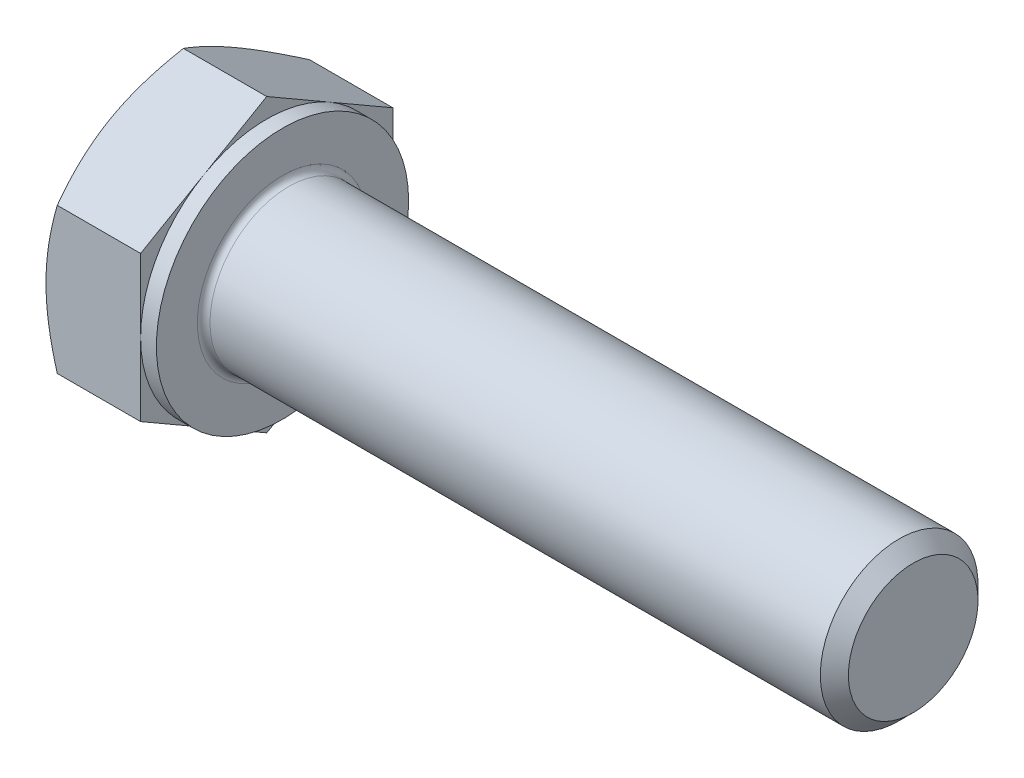
ISO-10303-21;
HEADER;
FILE_DESCRIPTION(('STEP AP214'),'2;1');
FILE_NAME('part.step','',(''),(''),'','','');
FILE_SCHEMA(('AUTOMOTIVE_DESIGN { 1 0 10303 214 1 1 1 1 }'));
ENDSEC;
DATA;
#1=APPLICATION_CONTEXT('core data for automotive mechanical design processes');
#2=APPLICATION_PROTOCOL_DEFINITION('international standard','automotive_design',2000,#1);
#3=PRODUCT_CONTEXT('',#1,'mechanical');
#4=PRODUCT('Part','Part','',(#3));
#5=PRODUCT_RELATED_PRODUCT_CATEGORY('part','',(#4));
#6=PRODUCT_DEFINITION_FORMATION('','',#4);
#7=PRODUCT_DEFINITION_CONTEXT('part definition',#1,'design');
#8=PRODUCT_DEFINITION('design','',#6,#7);
#9=PRODUCT_DEFINITION_SHAPE('','',#8);
#10=(LENGTH_UNIT() NAMED_UNIT(*) SI_UNIT(.MILLI.,.METRE.));
#11=(NAMED_UNIT(*) PLANE_ANGLE_UNIT() SI_UNIT($,.RADIAN.));
#12=(NAMED_UNIT(*) SI_UNIT($,.STERADIAN.) SOLID_ANGLE_UNIT());
#13=UNCERTAINTY_MEASURE_WITH_UNIT(LENGTH_MEASURE(1.E-05),#10,'distance_accuracy_value','');
#14=(GEOMETRIC_REPRESENTATION_CONTEXT(3) GLOBAL_UNCERTAINTY_ASSIGNED_CONTEXT((#13)) GLOBAL_UNIT_ASSIGNED_CONTEXT((#10,
#11,#12)) REPRESENTATION_CONTEXT('',''));
#15=CARTESIAN_POINT('',(0.,0.,0.));
#16=DIRECTION('',(0.,0.,1.));
#17=DIRECTION('',(1.,0.,0.));
#18=AXIS2_PLACEMENT_3D('',#15,#16,#17);
#19=CARTESIAN_POINT('',(3.5,4.61880215351701,0.));
#20=DIRECTION('',(1.,0.,0.));
#21=DIRECTION('',(0.,0.,-1.));
#22=AXIS2_PLACEMENT_3D('',#19,#20,#21);
#23=PLANE('',#22);
#24=CARTESIAN_POINT('',(3.5,0.,0.));
#25=DIRECTION('',(1.,0.,0.));
#26=DIRECTION('',(0.,0.,-1.));
#27=AXIS2_PLACEMENT_3D('',#24,#25,#26);
#28=CIRCLE('',#27,2.7);
#29=CARTESIAN_POINT('',(3.5,0.,-2.7));
#30=VERTEX_POINT('',#29);
#31=EDGE_CURVE('E46',#30,#30,#28,.F.);
#32=ORIENTED_EDGE('',*,*,#31,.T.);
#33=EDGE_LOOP('',(#32));
#34=FACE_BOUND('',#33,.T.);
#35=CARTESIAN_POINT('',(3.5,0.,0.));
#36=DIRECTION('',(1.,0.,0.));
#37=DIRECTION('',(0.,0.,-1.));
#38=AXIS2_PLACEMENT_3D('',#35,#36,#37);
#39=CIRCLE('',#38,4.);
#40=CARTESIAN_POINT('',(3.5,0.,-4.));
#41=VERTEX_POINT('',#40);
#42=EDGE_CURVE('E297',#41,#41,#39,.T.);
#43=ORIENTED_EDGE('',*,*,#42,.T.);
#44=EDGE_LOOP('',(#43));
#45=FACE_BOUND('',#44,.T.);
#46=ADVANCED_FACE('F38',(#34,#45),#23,.T.);
#47=CARTESIAN_POINT('',(0.,0.,0.));
#48=DIRECTION('',(-1.,0.,0.));
#49=DIRECTION('',(0.,0.,1.));
#50=AXIS2_PLACEMENT_3D('',#47,#48,#49);
#51=CYLINDRICAL_SURFACE('',#50,2.5);
#52=CARTESIAN_POINT('',(3.7,0.,0.));
#53=DIRECTION('',(1.,0.,0.));
#54=DIRECTION('',(0.,0.,-1.));
#55=AXIS2_PLACEMENT_3D('',#52,#53,#54);
#56=CIRCLE('',#55,2.5);
#57=CARTESIAN_POINT('',(3.7,0.,-2.5));
#58=VERTEX_POINT('',#57);
#59=EDGE_CURVE('E11',#58,#58,#56,.T.);
#60=ORIENTED_EDGE('',*,*,#59,.T.);
#61=EDGE_LOOP('',(#60));
#62=FACE_BOUND('',#61,.T.);
#63=CARTESIAN_POINT('',(23.055,0.,0.));
#64=DIRECTION('',(-1.,0.,0.));
#65=DIRECTION('',(0.,0.,1.));
#66=AXIS2_PLACEMENT_3D('',#63,#64,#65);
#67=CIRCLE('',#66,2.5);
#68=CARTESIAN_POINT('',(23.055,0.,2.5));
#69=VERTEX_POINT('',#68);
#70=EDGE_CURVE('E276',#69,#69,#67,.T.);
#71=ORIENTED_EDGE('',*,*,#70,.T.);
#72=EDGE_LOOP('',(#71));
#73=FACE_BOUND('',#72,.T.);
#74=ADVANCED_FACE('F250',(#62,#73),#51,.T.);
#75=CARTESIAN_POINT('',(23.5,0.,0.));
#76=DIRECTION('',(-1.,0.,0.));
#77=DIRECTION('',(0.,0.,1.));
#78=AXIS2_PLACEMENT_3D('',#75,#76,#77);
#79=CONICAL_SURFACE('',#78,2.055,0.785398163397439);
#80=ORIENTED_EDGE('',*,*,#70,.F.);
#81=EDGE_LOOP('',(#80));
#82=FACE_BOUND('',#81,.T.);
#83=CARTESIAN_POINT('',(23.5,0.,0.));
#84=DIRECTION('',(-1.,0.,0.));
#85=DIRECTION('',(0.,0.,1.));
#86=AXIS2_PLACEMENT_3D('',#83,#84,#85);
#87=CIRCLE('',#86,2.055);
#88=CARTESIAN_POINT('',(23.5,0.,2.055));
#89=VERTEX_POINT('',#88);
#90=EDGE_CURVE('E274',#89,#89,#87,.T.);
#91=ORIENTED_EDGE('',*,*,#90,.T.);
#92=EDGE_LOOP('',(#91));
#93=FACE_BOUND('',#92,.T.);
#94=ADVANCED_FACE('F255',(#82,#93),#79,.T.);
#95=CARTESIAN_POINT('',(23.5,0.,0.));
#96=DIRECTION('',(-1.,0.,0.));
#97=DIRECTION('',(0.,0.,1.));
#98=AXIS2_PLACEMENT_3D('',#95,#96,#97);
#99=PLANE('',#98);
#100=ORIENTED_EDGE('',*,*,#90,.F.);
#101=EDGE_LOOP('',(#100));
#102=FACE_BOUND('',#101,.T.);
#103=ADVANCED_FACE('F262',(#102),#99,.F.);
#104=CARTESIAN_POINT('',(3.,4.,0.));
#105=DIRECTION('',(1.,0.,0.));
#106=DIRECTION('',(0.,0.,-1.));
#107=AXIS2_PLACEMENT_3D('',#104,#105,#106);
#108=PLANE('',#107);
#109=DIRECTION('',(0.,0.500000000000001,0.866025403784438));
#110=VECTOR('',#109,1.);
#111=CARTESIAN_POINT('',(3.,2.3094010767585,-4.));
#112=LINE('',#111,#110);
#113=CARTESIAN_POINT('',(3.,2.3094010767585,-4.));
#114=VERTEX_POINT('',#113);
#115=CARTESIAN_POINT('',(3.,3.46410161513775,-2.));
#116=VERTEX_POINT('',#115);
#117=EDGE_CURVE('E170',#114,#116,#112,.T.);
#118=ORIENTED_EDGE('',*,*,#117,.T.);
#119=CARTESIAN_POINT('',(3.,0.,0.));
#120=DIRECTION('',(-1.,0.,0.));
#121=DIRECTION('',(0.,0.,1.));
#122=AXIS2_PLACEMENT_3D('',#119,#120,#121);
#123=CIRCLE('',#122,4.);
#124=CARTESIAN_POINT('',(3.,0.,-4.));
#125=VERTEX_POINT('',#124);
#126=EDGE_CURVE('E53',#116,#125,#123,.T.);
#127=ORIENTED_EDGE('',*,*,#126,.T.);
#128=DIRECTION('',(0.,1.,0.));
#129=VECTOR('',#128,1.);
#130=CARTESIAN_POINT('',(3.,2.3094010767585,-4.));
#131=LINE('',#130,#129);
#132=EDGE_CURVE('E300',#125,#114,#131,.T.);
#133=ORIENTED_EDGE('',*,*,#132,.T.);
#134=EDGE_LOOP('',(#118,#127,#133));
#135=FACE_BOUND('',#134,.T.);
#136=ADVANCED_FACE('F265',(#135),#108,.T.);
#137=CARTESIAN_POINT('',(3.,4.61880215351701,0.));
#138=VERTEX_POINT('',#137);
#139=EDGE_CURVE('E168',#116,#138,#112,.T.);
#140=ORIENTED_EDGE('',*,*,#139,.T.);
#141=DIRECTION('',(0.,-0.500000000000001,0.866025403784438));
#142=VECTOR('',#141,1.);
#143=CARTESIAN_POINT('',(3.,4.61880215351701,0.));
#144=LINE('',#143,#142);
#145=CARTESIAN_POINT('',(3.,3.46410161513775,2.));
#146=VERTEX_POINT('',#145);
#147=EDGE_CURVE('E167',#138,#146,#144,.T.);
#148=ORIENTED_EDGE('',*,*,#147,.T.);
#149=EDGE_CURVE('E156',#146,#116,#123,.T.);
#150=ORIENTED_EDGE('',*,*,#149,.T.);
#151=EDGE_LOOP('',(#140,#148,#150));
#152=FACE_BOUND('',#151,.T.);
#153=ADVANCED_FACE('F270',(#152),#108,.T.);
#154=CARTESIAN_POINT('',(3.,2.3094010767585,4.));
#155=VERTEX_POINT('',#154);
#156=EDGE_CURVE('E135',#146,#155,#144,.T.);
#157=ORIENTED_EDGE('',*,*,#156,.T.);
#158=DIRECTION('',(0.,-1.,0.));
#159=VECTOR('',#158,1.);
#160=CARTESIAN_POINT('',(3.,2.3094010767585,4.));
#161=LINE('',#160,#159);
#162=CARTESIAN_POINT('',(3.,0.,4.));
#163=VERTEX_POINT('',#162);
#164=EDGE_CURVE('E129',#155,#163,#161,.T.);
#165=ORIENTED_EDGE('',*,*,#164,.T.);
#166=EDGE_CURVE('E133',#163,#146,#123,.T.);
#167=ORIENTED_EDGE('',*,*,#166,.T.);
#168=EDGE_LOOP('',(#157,#165,#167));
#169=FACE_BOUND('',#168,.T.);
#170=ADVANCED_FACE('F131',(#169),#108,.T.);
#171=CARTESIAN_POINT('',(3.,-2.3094010767585,4.));
#172=VERTEX_POINT('',#171);
#173=EDGE_CURVE('E139',#163,#172,#161,.T.);
#174=ORIENTED_EDGE('',*,*,#173,.T.);
#175=DIRECTION('',(0.,-0.500000000000001,-0.866025403784438));
#176=VECTOR('',#175,1.);
#177=CARTESIAN_POINT('',(3.,-4.61880215351701,0.));
#178=LINE('',#177,#176);
#179=CARTESIAN_POINT('',(3.,-3.46410161513775,2.));
#180=VERTEX_POINT('',#179);
#181=EDGE_CURVE('E146',#172,#180,#178,.T.);
#182=ORIENTED_EDGE('',*,*,#181,.T.);
#183=EDGE_CURVE('E143',#180,#163,#123,.T.);
#184=ORIENTED_EDGE('',*,*,#183,.T.);
#185=EDGE_LOOP('',(#174,#182,#184));
#186=FACE_BOUND('',#185,.T.);
#187=ADVANCED_FACE('F144',(#186),#108,.T.);
#188=CARTESIAN_POINT('',(3.,-4.61880215351701,0.));
#189=VERTEX_POINT('',#188);
#190=EDGE_CURVE('E162',#180,#189,#178,.T.);
#191=ORIENTED_EDGE('',*,*,#190,.T.);
#192=DIRECTION('',(0.,0.5,-0.866025403784438));
#193=VECTOR('',#192,1.);
#194=CARTESIAN_POINT('',(3.,-2.30940107675851,-4.));
#195=LINE('',#194,#193);
#196=CARTESIAN_POINT('',(3.,-3.46410161513775,-2.));
#197=VERTEX_POINT('',#196);
#198=EDGE_CURVE('E338',#189,#197,#195,.T.);
#199=ORIENTED_EDGE('',*,*,#198,.T.);
#200=EDGE_CURVE('E150',#197,#180,#123,.T.);
#201=ORIENTED_EDGE('',*,*,#200,.T.);
#202=EDGE_LOOP('',(#191,#199,#201));
#203=FACE_BOUND('',#202,.T.);
#204=ADVANCED_FACE('F339',(#203),#108,.T.);
#205=CARTESIAN_POINT('',(3.,-2.30940107675851,-4.));
#206=VERTEX_POINT('',#205);
#207=EDGE_CURVE('E157',#197,#206,#195,.T.);
#208=ORIENTED_EDGE('',*,*,#207,.T.);
#209=EDGE_CURVE('E301',#206,#125,#131,.T.);
#210=ORIENTED_EDGE('',*,*,#209,.T.);
#211=EDGE_CURVE('E308',#125,#197,#123,.T.);
#212=ORIENTED_EDGE('',*,*,#211,.T.);
#213=EDGE_LOOP('',(#208,#210,#212));
#214=FACE_BOUND('',#213,.T.);
#215=ADVANCED_FACE('F271',(#214),#108,.T.);
#216=CARTESIAN_POINT('',(0.,0.,0.));
#217=DIRECTION('',(-1.,0.,0.));
#218=DIRECTION('',(0.,0.,1.));
#219=AXIS2_PLACEMENT_3D('',#216,#217,#218);
#220=CYLINDRICAL_SURFACE('',#219,4.);
#221=ORIENTED_EDGE('',*,*,#126,.F.);
#222=ORIENTED_EDGE('',*,*,#149,.F.);
#223=ORIENTED_EDGE('',*,*,#166,.F.);
#224=ORIENTED_EDGE('',*,*,#183,.F.);
#225=ORIENTED_EDGE('',*,*,#200,.F.);
#226=ORIENTED_EDGE('',*,*,#211,.F.);
#227=EDGE_LOOP('',(#221,#222,#223,#224,#225,#226));
#228=FACE_BOUND('',#227,.T.);
#229=ORIENTED_EDGE('',*,*,#42,.F.);
#230=EDGE_LOOP('',(#229));
#231=FACE_BOUND('',#230,.T.);
#232=ADVANCED_FACE('F153',(#228,#231),#220,.T.);
#233=CARTESIAN_POINT('',(0.,4.61880215351701,0.));
#234=DIRECTION('',(1.,0.,0.));
#235=DIRECTION('',(0.,0.,-1.));
#236=AXIS2_PLACEMENT_3D('',#233,#234,#235);
#237=PLANE('',#236);
#238=CARTESIAN_POINT('',(0.,0.,0.));
#239=DIRECTION('',(1.,0.,0.));
#240=DIRECTION('',(0.,0.,-1.));
#241=AXIS2_PLACEMENT_3D('',#238,#239,#240);
#242=CIRCLE('',#241,4.);
#243=CARTESIAN_POINT('',(0.,0.,-4.));
#244=VERTEX_POINT('',#243);
#245=CARTESIAN_POINT('',(0.,3.46410161513775,-2.));
#246=VERTEX_POINT('',#245);
#247=EDGE_CURVE('E296',#244,#246,#242,.T.);
#248=ORIENTED_EDGE('',*,*,#247,.F.);
#249=CARTESIAN_POINT('',(0.,-3.46410161513775,-2.));
#250=VERTEX_POINT('',#249);
#251=EDGE_CURVE('E292',#250,#244,#242,.T.);
#252=ORIENTED_EDGE('',*,*,#251,.F.);
#253=CARTESIAN_POINT('',(0.,-3.46410161513775,2.));
#254=VERTEX_POINT('',#253);
#255=EDGE_CURVE('E295',#254,#250,#242,.T.);
#256=ORIENTED_EDGE('',*,*,#255,.F.);
#257=CARTESIAN_POINT('',(0.,0.,4.));
#258=VERTEX_POINT('',#257);
#259=EDGE_CURVE('E331',#258,#254,#242,.T.);
#260=ORIENTED_EDGE('',*,*,#259,.F.);
#261=CARTESIAN_POINT('',(0.,0.,0.));
#262=DIRECTION('',(-1.,0.,0.));
#263=DIRECTION('',(0.,0.,1.));
#264=AXIS2_PLACEMENT_3D('',#261,#262,#263);
#265=CIRCLE('',#264,4.);
#266=CARTESIAN_POINT('',(0.,3.46410161513775,2.));
#267=VERTEX_POINT('',#266);
#268=EDGE_CURVE('E171',#258,#267,#265,.T.);
#269=ORIENTED_EDGE('',*,*,#268,.T.);
#270=EDGE_CURVE('E354',#246,#267,#242,.T.);
#271=ORIENTED_EDGE('',*,*,#270,.F.);
#272=EDGE_LOOP('',(#248,#252,#256,#260,#269,#271));
#273=FACE_BOUND('',#272,.T.);
#274=ADVANCED_FACE('F200',(#273),#237,.F.);
#275=CARTESIAN_POINT('',(0.,0.,0.));
#276=DIRECTION('',(1.,0.,0.));
#277=DIRECTION('',(0.,0.,-1.));
#278=AXIS2_PLACEMENT_3D('',#275,#276,#277);
#279=CONICAL_SURFACE('',#278,4.,1.0471975511966);
#280=CARTESIAN_POINT('',(0.357332259074765,2.30928560670466,4.0002));
#281=CARTESIAN_POINT('',(0.29871787364828,2.4107717464617,3.82442084967677));
#282=CARTESIAN_POINT('',(0.245410321462261,2.51313390883499,3.64712438367362));
#283=CARTESIAN_POINT('',(0.152361670746402,2.71963072479811,3.28946140682429));
#284=CARTESIAN_POINT('',(0.112653489029703,2.82376904741904,3.10908854102985));
#285=CARTESIAN_POINT('',(0.0508422152802781,3.03075510011795,2.75057818129721));
#286=CARTESIAN_POINT('',(0.0283277315228882,3.13357098372492,2.57249584706486));
#287=CARTESIAN_POINT('',(0.00145062314658159,3.33968651028528,2.21549328283349));
#288=CARTESIAN_POINT('',(-0.00293425857305684,3.44298540411434,2.0365743503559));
#289=CARTESIAN_POINT('',(0.00619007293997045,3.63600352522932,1.70225715780327));
#290=CARTESIAN_POINT('',(0.0174589539879946,3.72575165335065,1.54680884001293));
#291=CARTESIAN_POINT('',(0.0531739907981935,3.90466320392054,1.23692494436494));
#292=CARTESIAN_POINT('',(0.0776323457115334,3.99382600759479,1.08249043825587));
#293=CARTESIAN_POINT('',(0.13877606491929,4.17310641015197,0.771967672225422));
#294=CARTESIAN_POINT('',(0.175720603654864,4.26320131938131,0.615918711936898));
#295=CARTESIAN_POINT('',(0.259570072548028,4.44204742827551,0.306148164596161));
#296=CARTESIAN_POINT('',(0.306455302212741,4.53080091904967,0.152422609226221));
#297=CARTESIAN_POINT('',(0.357332259074768,4.61891762357085,-0.000199999999999949));
#298=B_SPLINE_CURVE_WITH_KNOTS('',3,(#280,#281,#282,#283,#284,#285,#286,#287,#288,#289,#290,
#291,#292,#293,#294,#295,#296,#297),.UNSPECIFIED.,.F.,.F.,(4,2,2,2,2,2,2,2,4),(0.,
0.634047835695966,1.26961969224543,1.88946157213122,2.50854226669297,3.04757825393386,
3.58711366126903,4.13861653143764,4.68903648037743),.UNSPECIFIED.);
#299=CARTESIAN_POINT('',(0.357265589908164,4.61880215351701,0.));
#300=VERTEX_POINT('',#299);
#301=EDGE_CURVE('E219',#267,#300,#298,.T.);
#302=ORIENTED_EDGE('',*,*,#301,.T.);
#303=CARTESIAN_POINT('',(0.357332259074767,4.61891762357085,0.000200000000000014));
#304=CARTESIAN_POINT('',(0.298717873648283,4.51743148381381,-0.175579150323228));
#305=CARTESIAN_POINT('',(0.245410321462263,4.41506932144052,-0.352875616326381));
#306=CARTESIAN_POINT('',(0.152361670746404,4.2085725054774,-0.710538593175706));
#307=CARTESIAN_POINT('',(0.112653489029704,4.10443418285647,-0.89091145897015));
#308=CARTESIAN_POINT('',(0.0508422152802789,3.89744813015756,-1.24942181870279));
#309=CARTESIAN_POINT('',(0.0283277315228886,3.79463224655059,-1.42750415293514));
#310=CARTESIAN_POINT('',(0.00145062314658167,3.58851671999023,-1.78450671716651));
#311=CARTESIAN_POINT('',(-0.00293425857305672,3.48521782616117,-1.9634256496441));
#312=CARTESIAN_POINT('',(0.00619007293996976,3.29219970504619,-2.29774284219673));
#313=CARTESIAN_POINT('',(0.0174589539879931,3.20245157692486,-2.45319115998706));
#314=CARTESIAN_POINT('',(0.0531739907981914,3.02354002635497,-2.76307505563505));
#315=CARTESIAN_POINT('',(0.0776323457115314,2.93437722268072,-2.91750956174413));
#316=CARTESIAN_POINT('',(0.138776064919287,2.75509682012354,-3.22803232777458));
#317=CARTESIAN_POINT('',(0.175720603654861,2.6650019108942,-3.3840812880631));
#318=CARTESIAN_POINT('',(0.259570072548024,2.486155802,-3.69385183540384));
#319=CARTESIAN_POINT('',(0.306455302212737,2.39740231122584,-3.84757739077378));
#320=CARTESIAN_POINT('',(0.357332259074764,2.30928560670466,-4.0002));
#321=B_SPLINE_CURVE_WITH_KNOTS('',3,(#303,#304,#305,#306,#307,#308,#309,#310,#311,#312,#313,
#314,#315,#316,#317,#318,#319,#320),.UNSPECIFIED.,.F.,.F.,(4,2,2,2,2,2,2,2,4),(0.,
0.634047835695966,1.26961969224543,1.88946157213122,2.50854226669297,3.04757825393386,
3.58711366126904,4.13861653143764,4.68903648037743),.UNSPECIFIED.);
#322=EDGE_CURVE('E61',#300,#246,#321,.T.);
#323=ORIENTED_EDGE('',*,*,#322,.T.);
#324=ORIENTED_EDGE('',*,*,#270,.T.);
#325=EDGE_LOOP('',(#302,#323,#324));
#326=FACE_BOUND('',#325,.T.);
#327=ADVANCED_FACE('F355',(#326),#279,.T.);
#328=CARTESIAN_POINT('',(2.00011120589743,-6.30203842761113,4.));
#329=CARTESIAN_POINT('',(1.91454696498875,-6.12645846908575,4.));
#330=CARTESIAN_POINT('',(1.82977515877993,-5.95048585830456,4.));
#331=CARTESIAN_POINT('',(1.66226027831945,-5.59754684504877,4.));
#332=CARTESIAN_POINT('',(1.57951750565517,-5.42058029958678,4.));
#333=CARTESIAN_POINT('',(1.41610926315704,-5.06457985358152,4.));
#334=CARTESIAN_POINT('',(1.33545672742033,-4.88553999633137,4.));
#335=CARTESIAN_POINT('',(1.17732358085363,-4.52607013308825,4.));
#336=CARTESIAN_POINT('',(1.09984282639237,-4.34564019048468,4.));
#337=CARTESIAN_POINT('',(0.946328318347817,-3.97695712450867,4.));
#338=CARTESIAN_POINT('',(0.870432704529691,-3.78864617668021,4.));
#339=CARTESIAN_POINT('',(0.724150215973389,-3.40985798992395,4.));
#340=CARTESIAN_POINT('',(0.653763945273171,-3.21938051607555,4.));
#341=CARTESIAN_POINT('',(0.520275623504083,-2.83628177128505,4.));
#342=CARTESIAN_POINT('',(0.457159651374154,-2.64366539864628,4.));
#343=CARTESIAN_POINT('',(0.34017151755484,-2.25567134331569,4.));
#344=CARTESIAN_POINT('',(0.286296547637719,-2.0602945190957,4.));
#345=CARTESIAN_POINT('',(0.190596079795568,-1.66775019580152,4.));
#346=CARTESIAN_POINT('',(0.148703055516465,-1.47059946092579,4.));
#347=CARTESIAN_POINT('',(0.0792701945625812,-1.07374632347739,4.));
#348=CARTESIAN_POINT('',(0.0517287925825736,-0.874044201615011,4.));
#349=CARTESIAN_POINT('',(0.0135517369810979,-0.475733691865664,4.));
#350=CARTESIAN_POINT('',(0.00269106568150293,-0.277147418102511,4.));
#351=CARTESIAN_POINT('',(-0.00180277185473733,0.120241437274123,4.));
#352=CARTESIAN_POINT('',(0.00456430935448244,0.319044021953526,4.));
#353=CARTESIAN_POINT('',(0.0293199842587319,0.653649133068292,4.));
#354=CARTESIAN_POINT('',(0.0433487696608965,0.789796206499808,4.));
#355=CARTESIAN_POINT('',(0.0786650587211739,1.06115179929909,4.));
#356=CARTESIAN_POINT('',(0.0999534653997814,1.19636019976989,4.));
#357=CARTESIAN_POINT('',(0.173595113230302,1.6003610897557,4.));
#358=CARTESIAN_POINT('',(0.235713609865278,1.86739658303731,4.));
#359=CARTESIAN_POINT('',(0.344187907647021,2.26690842404957,4.));
#360=CARTESIAN_POINT('',(0.383434484333356,2.40143348571872,4.));
#361=CARTESIAN_POINT('',(0.466191102609245,2.66917849490934,4.));
#362=CARTESIAN_POINT('',(0.509701177188772,2.8023984323233,4.));
#363=CARTESIAN_POINT('',(0.600271094434184,3.0675733938392,4.));
#364=CARTESIAN_POINT('',(0.647329943862148,3.19952876030403,4.));
#365=CARTESIAN_POINT('',(0.744425096631928,3.46233234223972,4.));
#366=CARTESIAN_POINT('',(0.794461330917672,3.5931805833084,4.));
#367=CARTESIAN_POINT('',(0.933355739925494,3.9462730239221,4.));
#368=CARTESIAN_POINT('',(1.0245987610664,4.16757823857484,4.));
#369=CARTESIAN_POINT('',(1.21247228495599,4.6078984992879,4.));
#370=CARTESIAN_POINT('',(1.30910339372387,4.82691328443148,4.));
#371=CARTESIAN_POINT('',(1.50647026715798,5.26317250533755,4.));
#372=CARTESIAN_POINT('',(1.60720747010151,5.48041628821979,4.));
#373=CARTESIAN_POINT('',(1.81181128644257,5.91342831956033,4.));
#374=CARTESIAN_POINT('',(1.91567799687904,6.12919652200915,4.));
#375=CARTESIAN_POINT('',(2.12601769056008,6.55988022094133,4.));
#376=CARTESIAN_POINT('',(2.23249454580639,6.77479382248027,4.));
#377=CARTESIAN_POINT('',(2.44739203770408,7.20364803216284,4.));
#378=CARTESIAN_POINT('',(2.55581269515436,7.41758862986447,4.));
#379=CARTESIAN_POINT('',(2.88334503640577,8.05812603677696,4.));
#380=CARTESIAN_POINT('',(3.10477549508713,8.48353660654959,4.));
#381=CARTESIAN_POINT('',(3.52798949521968,9.28704830568598,4.));
#382=CARTESIAN_POINT('',(3.72935795236482,9.66536913109686,4.));
#383=CARTESIAN_POINT('',(4.13451859351916,10.4207405604373,4.));
#384=CARTESIAN_POINT('',(4.33831092861575,10.7977910832853,3.99999999999999));
#385=CARTESIAN_POINT('',(4.74699525708428,11.5496417902084,3.99999999999999));
#386=CARTESIAN_POINT('',(4.95188119417863,11.9244452714923,3.99999999999999));
#387=CARTESIAN_POINT('',(5.36302659718326,12.6732594632005,3.99999999999999));
#388=CARTESIAN_POINT('',(5.56928595205576,13.0472702345667,3.99999999999999));
#389=CARTESIAN_POINT('',(5.7760450350038,13.42100281196,3.99999999999999));
#390=B_SPLINE_CURVE_WITH_KNOTS('',3,(#328,#329,#330,#331,#332,#333,#334,#335,#336,#337,#338,
#339,#340,#341,#342,#343,#344,#345,#346,#347,#348,#349,#350,#351,#352,#353,#354,#355,#356,#357,
#358,#359,#360,#361,#362,#363,#364,#365,#366,#367,#368,#369,#370,#371,#372,#373,#374,#375,#376,
#377,#378,#379,#380,#381,#382,#383,#384,#385,#386,#387,#388,#389),.UNSPECIFIED.,.F.,.F.,(4,2,2,
2,2,2,2,2,2,2,2,2,2,2,2,2,2,2,2,2,2,2,2,2,2,2,2,2,2,2,4),(0.,0.585964080082646,1.17201473397361,
1.76109183587772,2.35014223237615,2.95916537364923,3.56825519425104,4.17615863853847,
4.78387701983944,5.3880997905644,5.99225664601462,6.58818973021547,7.1841313739751,
7.59453803053127,8.00499575598947,8.82630884150173,9.2466697389851,9.66703388938198,
10.0872808210163,10.5075180094363,11.2255416710968,11.9436462552169,12.6620045748535,
13.3803851921263,14.0999050723894,14.8194326561991,16.2581595564571,17.5438734456803,
18.8296679016496,20.1111105471136,21.3924508191106),.UNSPECIFIED.);
#391=CARTESIAN_POINT('',(0.35726558990816,2.3094010767585,4.));
#392=VERTEX_POINT('',#391);
#393=EDGE_CURVE('E231',#258,#392,#390,.T.);
#394=ORIENTED_EDGE('',*,*,#393,.T.);
#395=EDGE_CURVE('E230',#392,#267,#298,.T.);
#396=ORIENTED_EDGE('',*,*,#395,.T.);
#397=ORIENTED_EDGE('',*,*,#268,.F.);
#398=EDGE_LOOP('',(#394,#396,#397));
#399=FACE_BOUND('',#398,.T.);
#400=ADVANCED_FACE('F325',(#399),#279,.T.);
#401=CARTESIAN_POINT('',(0.357265589908162,-2.3094010767585,4.));
#402=VERTEX_POINT('',#401);
#403=EDGE_CURVE('E277',#402,#258,#390,.T.);
#404=ORIENTED_EDGE('',*,*,#403,.T.);
#405=ORIENTED_EDGE('',*,*,#259,.T.);
#406=CARTESIAN_POINT('',(0.357332259074769,-4.61891762357085,-0.000199999999999893));
#407=CARTESIAN_POINT('',(0.298717873648285,-4.51743148381381,0.175579150323228));
#408=CARTESIAN_POINT('',(0.245410321462265,-4.41506932144052,0.352875616326381));
#409=CARTESIAN_POINT('',(0.152361670746406,-4.2085725054774,0.710538593175707));
#410=CARTESIAN_POINT('',(0.112653489029706,-4.10443418285647,0.890911458970151));
#411=CARTESIAN_POINT('',(0.0508422152802807,-3.89744813015756,1.24942181870279));
#412=CARTESIAN_POINT('',(0.0283277315228903,-3.7946322465506,1.42750415293514));
#413=CARTESIAN_POINT('',(0.00145062314658299,-3.58851671999023,1.78450671716651));
#414=CARTESIAN_POINT('',(-0.00293425857305564,-3.48521782616117,1.9634256496441));
#415=CARTESIAN_POINT('',(0.00619007293997126,-3.29219970504619,2.29774284219673));
#416=CARTESIAN_POINT('',(0.0174589539879951,-3.20245157692487,2.45319115998707));
#417=CARTESIAN_POINT('',(0.0531739907981936,-3.02354002635497,2.76307505563506));
#418=CARTESIAN_POINT('',(0.0776323457115331,-2.93437722268073,2.91750956174413));
#419=CARTESIAN_POINT('',(0.138776064919289,-2.75509682012354,3.22803232777458));
#420=CARTESIAN_POINT('',(0.175720603654863,-2.6650019108942,3.3840812880631));
#421=CARTESIAN_POINT('',(0.259570072548026,-2.48615580200001,3.69385183540384));
#422=CARTESIAN_POINT('',(0.306455302212739,-2.39740231122585,3.84757739077378));
#423=CARTESIAN_POINT('',(0.357332259074765,-2.30928560670467,4.0002));
#424=B_SPLINE_CURVE_WITH_KNOTS('',3,(#406,#407,#408,#409,#410,#411,#412,#413,#414,#415,#416,
#417,#418,#419,#420,#421,#422,#423),.UNSPECIFIED.,.F.,.F.,(4,2,2,2,2,2,2,2,4),(0.,
0.634047835695967,1.26961969224544,1.88946157213122,2.50854226669297,3.04757825393386,
3.58711366126904,4.13861653143764,4.68903648037743),.UNSPECIFIED.);
#425=EDGE_CURVE('E221',#254,#402,#424,.T.);
#426=ORIENTED_EDGE('',*,*,#425,.T.);
#427=EDGE_LOOP('',(#404,#405,#426));
#428=FACE_BOUND('',#427,.T.);
#429=ADVANCED_FACE('F189',(#428),#279,.T.);
#430=CARTESIAN_POINT('',(0.357265589908165,-4.61880215351701,0.));
#431=VERTEX_POINT('',#430);
#432=EDGE_CURVE('E214',#431,#254,#424,.T.);
#433=ORIENTED_EDGE('',*,*,#432,.T.);
#434=ORIENTED_EDGE('',*,*,#255,.T.);
#435=CARTESIAN_POINT('',(0.357332259074767,-2.30928560670467,-4.0002));
#436=CARTESIAN_POINT('',(0.298717873648283,-2.41077174646171,-3.82442084967677));
#437=CARTESIAN_POINT('',(0.245410321462263,-2.513133908835,-3.64712438367362));
#438=CARTESIAN_POINT('',(0.152361670746404,-2.71963072479812,-3.28946140682429));
#439=CARTESIAN_POINT('',(0.112653489029705,-2.82376904741905,-3.10908854102985));
#440=CARTESIAN_POINT('',(0.0508422152802804,-3.03075510011796,-2.75057818129721));
#441=CARTESIAN_POINT('',(0.0283277315228907,-3.13357098372492,-2.57249584706486));
#442=CARTESIAN_POINT('',(0.00145062314658398,-3.33968651028529,-2.21549328283349));
#443=CARTESIAN_POINT('',(-0.00293425857305478,-3.44298540411435,-2.0365743503559));
#444=CARTESIAN_POINT('',(0.00619007293997239,-3.63600352522933,-1.70225715780327));
#445=CARTESIAN_POINT('',(0.0174589539879966,-3.72575165335065,-1.54680884001293));
#446=CARTESIAN_POINT('',(0.0531739907981956,-3.90466320392055,-1.23692494436494));
#447=CARTESIAN_POINT('',(0.0776323457115355,-3.99382600759479,-1.08249043825587));
#448=CARTESIAN_POINT('',(0.138776064919292,-4.17310641015198,-0.771967672225422));
#449=CARTESIAN_POINT('',(0.175720603654866,-4.26320131938132,-0.615918711936898));
#450=CARTESIAN_POINT('',(0.25957007254803,-4.44204742827551,-0.30614816459616));
#451=CARTESIAN_POINT('',(0.306455302212743,-4.53080091904967,-0.15242260922622));
#452=CARTESIAN_POINT('',(0.357332259074769,-4.61891762357085,0.000200000000000426));
#453=B_SPLINE_CURVE_WITH_KNOTS('',3,(#435,#436,#437,#438,#439,#440,#441,#442,#443,#444,#445,
#446,#447,#448,#449,#450,#451,#452),.UNSPECIFIED.,.F.,.F.,(4,2,2,2,2,2,2,2,4),(0.,
0.634047835695966,1.26961969224543,1.88946157213122,2.50854226669297,3.04757825393386,
3.58711366126903,4.13861653143764,4.68903648037743),.UNSPECIFIED.);
#454=EDGE_CURVE('E220',#250,#431,#453,.T.);
#455=ORIENTED_EDGE('',*,*,#454,.T.);
#456=EDGE_LOOP('',(#433,#434,#455));
#457=FACE_BOUND('',#456,.T.);
#458=ADVANCED_FACE('F353',(#457),#279,.T.);
#459=CARTESIAN_POINT('',(0.35726558990816,2.3094010767585,-4.));
#460=VERTEX_POINT('',#459);
#461=EDGE_CURVE('E222',#246,#460,#321,.T.);
#462=ORIENTED_EDGE('',*,*,#461,.T.);
#463=CARTESIAN_POINT('',(2.00011120385047,-6.30203842341183,-4.));
#464=CARTESIAN_POINT('',(1.91454696302707,-6.12645846502785,-4.));
#465=CARTESIAN_POINT('',(1.82977515690347,-5.95048585438817,-4.));
#466=CARTESIAN_POINT('',(1.66226027661304,-5.59754684141582,-4.));
#467=CARTESIAN_POINT('',(1.57951750403358,-5.42058029609576,-4.));
#468=CARTESIAN_POINT('',(1.41610926170511,-5.06457985037649,-4.));
#469=CARTESIAN_POINT('',(1.33545672605324,-4.8855399932704,-4.));
#470=CARTESIAN_POINT('',(1.17732357965483,-4.52607013031638,-4.));
#471=CARTESIAN_POINT('',(1.09984282527702,-4.34564018785784,-4.));
#472=CARTESIAN_POINT('',(0.946328317401941,-3.97695712218343,-4.));
#473=CARTESIAN_POINT('',(0.870432703669647,-3.78864617451164,-4.));
#474=CARTESIAN_POINT('',(0.724150215280474,-3.40985798807121,-4.));
#475=CARTESIAN_POINT('',(0.653763944661552,-3.21938051438197,-4.));
#476=CARTESIAN_POINT('',(0.520275623047372,-2.83628176991274,-4.));
#477=CARTESIAN_POINT('',(0.457159650991077,-2.64366539743606,-4.));
#478=CARTESIAN_POINT('',(0.340171517307159,-2.25567134243403,-4.));
#479=CARTESIAN_POINT('',(0.286296547451807,-2.06029451838052,-4.));
#480=CARTESIAN_POINT('',(0.190596079734459,-1.66775019550379,-4.));
#481=CARTESIAN_POINT('',(0.148703055513724,-1.4705994608802,-4.));
#482=CARTESIAN_POINT('',(0.0792701946386928,-1.07374632394227,-4.));
#483=CARTESIAN_POINT('',(0.051728792679198,-0.874044202338206,-4.));
#484=CARTESIAN_POINT('',(0.013551737072628,-0.475733693101286,-4.));
#485=CARTESIAN_POINT('',(0.00269106574828971,-0.277147419592185,-4.));
#486=CARTESIAN_POINT('',(-0.00180277188208268,0.120241435280096,-4.));
#487=CARTESIAN_POINT('',(0.00456430925773773,0.3190440197092,-4.));
#488=CARTESIAN_POINT('',(0.0293199840216137,0.653649130511194,-4.));
#489=CARTESIAN_POINT('',(0.0433487693682718,0.789796203877394,-4.));
#490=CARTESIAN_POINT('',(0.0786650583146091,1.06115179654901,-4.));
#491=CARTESIAN_POINT('',(0.0999534649347825,1.19636019695746,-4.));
#492=CARTESIAN_POINT('',(0.173595112588807,1.6003610867597,-4.));
#493=CARTESIAN_POINT('',(0.2357136091046,1.86739657992385,-4.));
#494=CARTESIAN_POINT('',(0.344187906710574,2.26690842076044,-4.));
#495=CARTESIAN_POINT('',(0.383434483337919,2.40143348236974,-4.));
#496=CARTESIAN_POINT('',(0.466191101497675,2.66917849144137,-4.));
#497=CARTESIAN_POINT('',(0.50970117602006,2.80239842879618,-4.));
#498=CARTESIAN_POINT('',(0.600271093153281,3.06757339019424,-4.));
#499=CARTESIAN_POINT('',(0.647329942526199,3.19952875660037,-4.));
#500=CARTESIAN_POINT('',(0.744425095187847,3.46233233841866,-4.));
#501=CARTESIAN_POINT('',(0.794461329420505,3.59318057942864,-4.));
#502=CARTESIAN_POINT('',(0.933355738336682,3.9462730200095,-4.));
#503=CARTESIAN_POINT('',(1.02459875944487,4.16757823468633,-4.));
#504=CARTESIAN_POINT('',(1.21247228327857,4.60789849544446,-4.));
#505=CARTESIAN_POINT('',(1.30910339202327,4.82691328060901,-4.));
#506=CARTESIAN_POINT('',(1.50647026541792,5.26317250155476,-4.));
#507=CARTESIAN_POINT('',(1.60720746834516,5.48041628445571,-4.));
#508=CARTESIAN_POINT('',(1.81181128465854,5.91342831583169,-4.));
#509=CARTESIAN_POINT('',(1.91567799508361,6.12919651829724,-4.));
#510=CARTESIAN_POINT('',(2.1260176887459,6.55988021726237,-4.));
#511=CARTESIAN_POINT('',(2.23249454398486,6.77479381881753,-4.));
#512=CARTESIAN_POINT('',(2.44739203587053,7.20364802853132,-4.));
#513=CARTESIAN_POINT('',(2.55581269331614,7.41758862624796,-4.));
#514=CARTESIAN_POINT('',(2.88334503455633,8.05812603320372,-4.));
#515=CARTESIAN_POINT('',(3.10477549323411,8.48353660300322,-4.));
#516=CARTESIAN_POINT('',(3.52798949335262,9.2870483021662,-4.));
#517=CARTESIAN_POINT('',(3.72935795048665,9.66536912757712,-4.));
#518=CARTESIAN_POINT('',(4.13451859162103,10.4207405569166,-4.));
#519=CARTESIAN_POINT('',(4.33831092670878,10.7977910797636,-4.));
#520=CARTESIAN_POINT('',(4.74699525515911,11.5496417866802,-4.));
#521=CARTESIAN_POINT('',(4.95188119224406,11.9244452679585,-4.));
#522=CARTESIAN_POINT('',(5.36302659523093,12.673259459655,-4.));
#523=CARTESIAN_POINT('',(5.56928595009505,13.0472702310149,-4.));
#524=CARTESIAN_POINT('',(5.77604503303505,13.4210028084018,-4.));
#525=B_SPLINE_CURVE_WITH_KNOTS('',3,(#463,#464,#465,#466,#467,#468,#469,#470,#471,#472,#473,
#474,#475,#476,#477,#478,#479,#480,#481,#482,#483,#484,#485,#486,#487,#488,#489,#490,#491,#492,
#493,#494,#495,#496,#497,#498,#499,#500,#501,#502,#503,#504,#505,#506,#507,#508,#509,#510,#511,
#512,#513,#514,#515,#516,#517,#518,#519,#520,#521,#522,#523,#524),.UNSPECIFIED.,.F.,.F.,(4,2,2,
2,2,2,2,2,2,2,2,2,2,2,2,2,2,2,2,2,2,2,2,2,2,2,2,2,2,2,4),(0.,0.585964079589228,1.1720147329867,
1.76109183439221,2.35014223039207,2.95916537113302,3.56825519120251,4.17615863495934,
4.78387701573011,5.38809978568042,5.99225664035712,6.58818972380394,7.1841313668092,
7.59453802315344,8.00499574839967,8.82630883348707,9.24666973074843,9.66703388092333,
10.0872808123363,10.5075180005348,11.2255416622244,11.9436462463738,12.6620045660407,
13.3803851833438,14.0999050636407,14.8194326474842,16.2581595478086,17.5438734370163,
18.8296678929703,20.1111105384062,21.3924508103747),.UNSPECIFIED.);
#526=EDGE_CURVE('E182',#460,#244,#525,.F.);
#527=ORIENTED_EDGE('',*,*,#526,.T.);
#528=ORIENTED_EDGE('',*,*,#247,.T.);
#529=EDGE_LOOP('',(#462,#527,#528));
#530=FACE_BOUND('',#529,.T.);
#531=ADVANCED_FACE('F350',(#530),#279,.T.);
#532=CARTESIAN_POINT('',(0.357265589908045,-2.30940107675869,-4.));
#533=VERTEX_POINT('',#532);
#534=EDGE_CURVE('E183',#533,#250,#453,.T.);
#535=ORIENTED_EDGE('',*,*,#534,.T.);
#536=ORIENTED_EDGE('',*,*,#251,.T.);
#537=EDGE_CURVE('E174',#244,#533,#525,.F.);
#538=ORIENTED_EDGE('',*,*,#537,.T.);
#539=EDGE_LOOP('',(#535,#536,#538));
#540=FACE_BOUND('',#539,.T.);
#541=ADVANCED_FACE('F198',(#540),#279,.T.);
#542=CARTESIAN_POINT('',(3.5,2.3094010767585,-4.));
#543=DIRECTION('',(0.,0.,1.));
#544=DIRECTION('',(1.,0.,0.));
#545=AXIS2_PLACEMENT_3D('',#542,#543,#544);
#546=PLANE('',#545);
#547=ORIENTED_EDGE('',*,*,#209,.F.);
#548=DIRECTION('',(-1.,0.,0.));
#549=VECTOR('',#548,1.);
#550=CARTESIAN_POINT('',(3.5,-2.30940107675851,-4.));
#551=LINE('',#550,#549);
#552=EDGE_CURVE('E283',#206,#533,#551,.T.);
#553=ORIENTED_EDGE('',*,*,#552,.T.);
#554=ORIENTED_EDGE('',*,*,#537,.F.);
#555=ORIENTED_EDGE('',*,*,#526,.F.);
#556=DIRECTION('',(-1.,0.,0.));
#557=VECTOR('',#556,1.);
#558=CARTESIAN_POINT('',(3.5,2.3094010767585,-4.));
#559=LINE('',#558,#557);
#560=EDGE_CURVE('E279',#114,#460,#559,.T.);
#561=ORIENTED_EDGE('',*,*,#560,.F.);
#562=ORIENTED_EDGE('',*,*,#132,.F.);
#563=EDGE_LOOP('',(#547,#553,#554,#555,#561,#562));
#564=FACE_BOUND('',#563,.T.);
#565=ADVANCED_FACE('F193',(#564),#546,.F.);
#566=CARTESIAN_POINT('',(3.5,-2.30940107675851,-4.));
#567=DIRECTION('',(0.,0.866025403784438,0.5));
#568=DIRECTION('',(0.,-0.5,0.866025403784438));
#569=AXIS2_PLACEMENT_3D('',#566,#567,#568);
#570=PLANE('',#569);
#571=ORIENTED_EDGE('',*,*,#198,.F.);
#572=DIRECTION('',(-1.,0.,0.));
#573=VECTOR('',#572,1.);
#574=CARTESIAN_POINT('',(3.5,-4.61880215351701,0.));
#575=LINE('',#574,#573);
#576=EDGE_CURVE('E285',#189,#431,#575,.T.);
#577=ORIENTED_EDGE('',*,*,#576,.T.);
#578=ORIENTED_EDGE('',*,*,#454,.F.);
#579=ORIENTED_EDGE('',*,*,#534,.F.);
#580=ORIENTED_EDGE('',*,*,#552,.F.);
#581=ORIENTED_EDGE('',*,*,#207,.F.);
#582=EDGE_LOOP('',(#571,#577,#578,#579,#580,#581));
#583=FACE_BOUND('',#582,.T.);
#584=ADVANCED_FACE('F197',(#583),#570,.F.);
#585=CARTESIAN_POINT('',(3.5,-4.61880215351701,0.));
#586=DIRECTION('',(0.,0.866025403784438,-0.500000000000001));
#587=DIRECTION('',(0.,0.500000000000001,0.866025403784438));
#588=AXIS2_PLACEMENT_3D('',#585,#586,#587);
#589=PLANE('',#588);
#590=ORIENTED_EDGE('',*,*,#181,.F.);
#591=DIRECTION('',(-1.,0.,0.));
#592=VECTOR('',#591,1.);
#593=CARTESIAN_POINT('',(3.5,-2.3094010767585,4.));
#594=LINE('',#593,#592);
#595=EDGE_CURVE('E161',#172,#402,#594,.T.);
#596=ORIENTED_EDGE('',*,*,#595,.T.);
#597=ORIENTED_EDGE('',*,*,#425,.F.);
#598=ORIENTED_EDGE('',*,*,#432,.F.);
#599=ORIENTED_EDGE('',*,*,#576,.F.);
#600=ORIENTED_EDGE('',*,*,#190,.F.);
#601=EDGE_LOOP('',(#590,#596,#597,#598,#599,#600));
#602=FACE_BOUND('',#601,.T.);
#603=ADVANCED_FACE('F205',(#602),#589,.F.);
#604=CARTESIAN_POINT('',(3.5,2.3094010767585,4.));
#605=DIRECTION('',(0.,0.,-1.));
#606=DIRECTION('',(0.,1.,0.));
#607=AXIS2_PLACEMENT_3D('',#604,#605,#606);
#608=PLANE('',#607);
#609=ORIENTED_EDGE('',*,*,#164,.F.);
#610=DIRECTION('',(-1.,0.,0.));
#611=VECTOR('',#610,1.);
#612=CARTESIAN_POINT('',(3.5,2.3094010767585,4.));
#613=LINE('',#612,#611);
#614=EDGE_CURVE('E288',#155,#392,#613,.T.);
#615=ORIENTED_EDGE('',*,*,#614,.T.);
#616=ORIENTED_EDGE('',*,*,#393,.F.);
#617=ORIENTED_EDGE('',*,*,#403,.F.);
#618=ORIENTED_EDGE('',*,*,#595,.F.);
#619=ORIENTED_EDGE('',*,*,#173,.F.);
#620=EDGE_LOOP('',(#609,#615,#616,#617,#618,#619));
#621=FACE_BOUND('',#620,.T.);
#622=ADVANCED_FACE('F159',(#621),#608,.F.);
#623=CARTESIAN_POINT('',(3.5,4.61880215351701,0.));
#624=DIRECTION('',(0.,-0.866025403784438,-0.500000000000001));
#625=DIRECTION('',(0.,0.500000000000001,-0.866025403784438));
#626=AXIS2_PLACEMENT_3D('',#623,#624,#625);
#627=PLANE('',#626);
#628=ORIENTED_EDGE('',*,*,#147,.F.);
#629=DIRECTION('',(-1.,0.,0.));
#630=VECTOR('',#629,1.);
#631=CARTESIAN_POINT('',(3.5,4.61880215351701,0.));
#632=LINE('',#631,#630);
#633=EDGE_CURVE('E290',#138,#300,#632,.T.);
#634=ORIENTED_EDGE('',*,*,#633,.T.);
#635=ORIENTED_EDGE('',*,*,#301,.F.);
#636=ORIENTED_EDGE('',*,*,#395,.F.);
#637=ORIENTED_EDGE('',*,*,#614,.F.);
#638=ORIENTED_EDGE('',*,*,#156,.F.);
#639=EDGE_LOOP('',(#628,#634,#635,#636,#637,#638));
#640=FACE_BOUND('',#639,.T.);
#641=ADVANCED_FACE('F236',(#640),#627,.F.);
#642=CARTESIAN_POINT('',(3.5,2.3094010767585,-4.));
#643=DIRECTION('',(0.,-0.866025403784438,0.500000000000001));
#644=DIRECTION('',(0.,-0.500000000000001,-0.866025403784438));
#645=AXIS2_PLACEMENT_3D('',#642,#643,#644);
#646=PLANE('',#645);
#647=ORIENTED_EDGE('',*,*,#117,.F.);
#648=ORIENTED_EDGE('',*,*,#560,.T.);
#649=ORIENTED_EDGE('',*,*,#461,.F.);
#650=ORIENTED_EDGE('',*,*,#322,.F.);
#651=ORIENTED_EDGE('',*,*,#633,.F.);
#652=ORIENTED_EDGE('',*,*,#139,.F.);
#653=EDGE_LOOP('',(#647,#648,#649,#650,#651,#652));
#654=FACE_BOUND('',#653,.T.);
#655=ADVANCED_FACE('F239',(#654),#646,.F.);
#656=CARTESIAN_POINT('',(3.7,0.,0.));
#657=DIRECTION('',(1.,0.,0.));
#658=DIRECTION('',(0.,0.,-1.));
#659=AXIS2_PLACEMENT_3D('',#656,#657,#658);
#660=TOROIDAL_SURFACE('',#659,2.7,0.2);
#661=ORIENTED_EDGE('',*,*,#59,.F.);
#662=EDGE_LOOP('',(#661));
#663=FACE_BOUND('',#662,.T.);
#664=ORIENTED_EDGE('',*,*,#31,.F.);
#665=EDGE_LOOP('',(#664));
#666=FACE_BOUND('',#665,.T.);
#667=ADVANCED_FACE('F40',(#663,#666),#660,.F.);
#668=CLOSED_SHELL('',(#46,#74,#94,#103,#136,#153,#170,#187,#204,#215,#232,#274,#327,#400,#429,
#458,#531,#541,#565,#584,#603,#622,#641,#655,#667));
#669=MANIFOLD_SOLID_BREP('B2',#668);
#670=ADVANCED_BREP_SHAPE_REPRESENTATION('',(#18,#669),#14);
#671=SHAPE_DEFINITION_REPRESENTATION(#9,#670);
ENDSEC;
END-ISO-10303-21;
